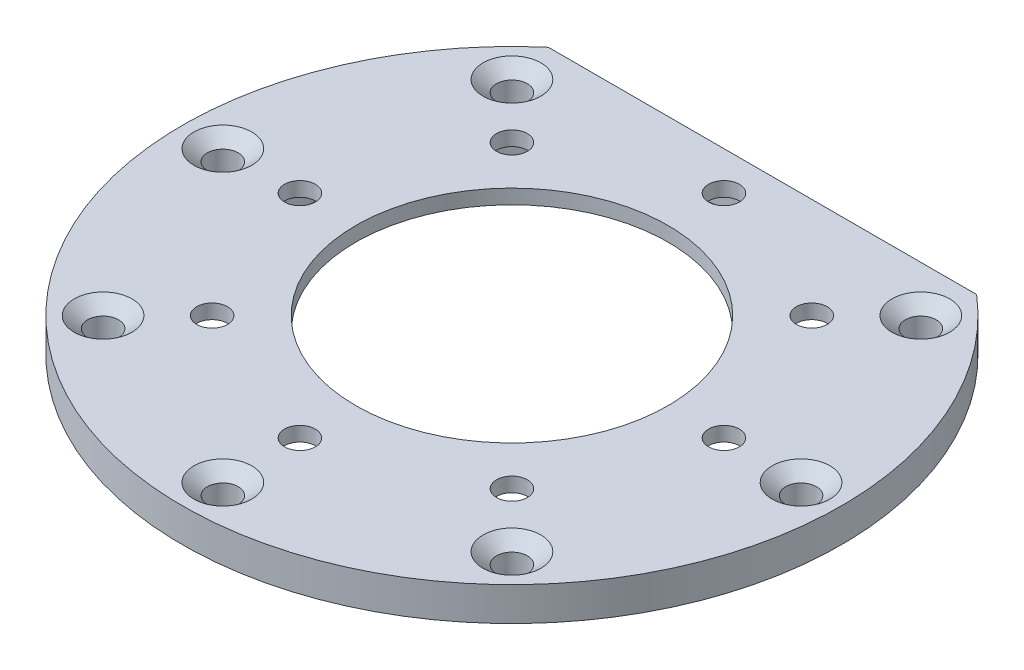
ISO-10303-21;
HEADER;
FILE_DESCRIPTION(('STEP AP214'),'2;1');
FILE_NAME('part.step','',(''),(''),'','','');
FILE_SCHEMA(('AUTOMOTIVE_DESIGN { 1 0 10303 214 1 1 1 1 }'));
ENDSEC;
DATA;
#1=APPLICATION_CONTEXT('core data for automotive mechanical design processes');
#2=APPLICATION_PROTOCOL_DEFINITION('international standard','automotive_design',2000,#1);
#3=PRODUCT_CONTEXT('',#1,'mechanical');
#4=PRODUCT('Part','Part','',(#3));
#5=PRODUCT_RELATED_PRODUCT_CATEGORY('part','',(#4));
#6=PRODUCT_DEFINITION_FORMATION('','',#4);
#7=PRODUCT_DEFINITION_CONTEXT('part definition',#1,'design');
#8=PRODUCT_DEFINITION('design','',#6,#7);
#9=PRODUCT_DEFINITION_SHAPE('','',#8);
#10=(LENGTH_UNIT() NAMED_UNIT(*) SI_UNIT(.MILLI.,.METRE.));
#11=(NAMED_UNIT(*) PLANE_ANGLE_UNIT() SI_UNIT($,.RADIAN.));
#12=(NAMED_UNIT(*) SI_UNIT($,.STERADIAN.) SOLID_ANGLE_UNIT());
#13=UNCERTAINTY_MEASURE_WITH_UNIT(LENGTH_MEASURE(1.E-05),#10,'distance_accuracy_value','');
#14=(GEOMETRIC_REPRESENTATION_CONTEXT(3) GLOBAL_UNCERTAINTY_ASSIGNED_CONTEXT((#13)) GLOBAL_UNIT_ASSIGNED_CONTEXT((#10,
#11,#12)) REPRESENTATION_CONTEXT('',''));
#15=CARTESIAN_POINT('',(0.,0.,0.));
#16=DIRECTION('',(0.,0.,1.));
#17=DIRECTION('',(1.,0.,0.));
#18=AXIS2_PLACEMENT_3D('',#15,#16,#17);
#19=CARTESIAN_POINT('',(34.2,3.5,0.));
#20=DIRECTION('',(0.,-1.,0.));
#21=DIRECTION('',(0.,0.,-1.));
#22=AXIS2_PLACEMENT_3D('',#19,#20,#21);
#23=PLANE('',#22);
#24=CARTESIAN_POINT('',(-30.,3.5,0.));
#25=DIRECTION('',(0.,1.,0.));
#26=DIRECTION('',(0.,0.,1.));
#27=AXIS2_PLACEMENT_3D('',#24,#25,#26);
#28=CIRCLE('',#27,3.);
#29=CARTESIAN_POINT('',(-30.,3.5,3.));
#30=VERTEX_POINT('',#29);
#31=EDGE_CURVE('E93',#30,#30,#28,.T.);
#32=ORIENTED_EDGE('',*,*,#31,.F.);
#33=EDGE_LOOP('',(#32));
#34=FACE_BOUND('',#33,.T.);
#35=CARTESIAN_POINT('',(-1.04744440165294E-13,3.5,30.));
#36=DIRECTION('',(0.,1.,0.));
#37=DIRECTION('',(0.,0.,1.));
#38=AXIS2_PLACEMENT_3D('',#35,#36,#37);
#39=CIRCLE('',#38,3.);
#40=CARTESIAN_POINT('',(-1.04744440165294E-13,3.5,33.));
#41=VERTEX_POINT('',#40);
#42=EDGE_CURVE('E111',#41,#41,#39,.T.);
#43=ORIENTED_EDGE('',*,*,#42,.F.);
#44=EDGE_LOOP('',(#43));
#45=FACE_BOUND('',#44,.T.);
#46=CARTESIAN_POINT('',(21.2132034355964,3.5,21.2132034355965));
#47=DIRECTION('',(0.,1.,0.));
#48=DIRECTION('',(0.,0.,1.));
#49=AXIS2_PLACEMENT_3D('',#46,#47,#48);
#50=CIRCLE('',#49,3.);
#51=CARTESIAN_POINT('',(21.2132034355964,3.5,24.2132034355965));
#52=VERTEX_POINT('',#51);
#53=EDGE_CURVE('E120',#52,#52,#50,.T.);
#54=ORIENTED_EDGE('',*,*,#53,.F.);
#55=EDGE_LOOP('',(#54));
#56=FACE_BOUND('',#55,.T.);
#57=CARTESIAN_POINT('',(0.,3.5,22.));
#58=DIRECTION('',(0.,1.,0.));
#59=DIRECTION('',(-1.,0.,0.));
#60=AXIS2_PLACEMENT_3D('',#57,#58,#59);
#61=CIRCLE('',#60,1.6);
#62=CARTESIAN_POINT('',(-1.60000000000007,3.5,22.));
#63=VERTEX_POINT('',#62);
#64=EDGE_CURVE('E130',#63,#63,#61,.T.);
#65=ORIENTED_EDGE('',*,*,#64,.F.);
#66=EDGE_LOOP('',(#65));
#67=FACE_BOUND('',#66,.T.);
#68=CARTESIAN_POINT('',(-15.5563491861041,3.5,15.556349186104));
#69=DIRECTION('',(0.,1.,0.));
#70=DIRECTION('',(-0.707106781186544,0.,-0.707106781186551));
#71=AXIS2_PLACEMENT_3D('',#68,#69,#70);
#72=CIRCLE('',#71,1.6);
#73=CARTESIAN_POINT('',(-16.6877200360026,3.5,14.4249783362055));
#74=VERTEX_POINT('',#73);
#75=EDGE_CURVE('E134',#74,#74,#72,.T.);
#76=ORIENTED_EDGE('',*,*,#75,.F.);
#77=EDGE_LOOP('',(#76));
#78=FACE_BOUND('',#77,.T.);
#79=CARTESIAN_POINT('',(-22.,3.5,0.));
#80=DIRECTION('',(0.,1.,0.));
#81=DIRECTION('',(0.,0.,-1.));
#82=AXIS2_PLACEMENT_3D('',#79,#80,#81);
#83=CIRCLE('',#82,1.6);
#84=CARTESIAN_POINT('',(-22.,3.5,-1.6));
#85=VERTEX_POINT('',#84);
#86=EDGE_CURVE('E137',#85,#85,#83,.T.);
#87=ORIENTED_EDGE('',*,*,#86,.F.);
#88=EDGE_LOOP('',(#87));
#89=FACE_BOUND('',#88,.T.);
#90=CARTESIAN_POINT('',(-15.5563491861039,3.5,-15.5563491861042));
#91=DIRECTION('',(0.,1.,0.));
#92=DIRECTION('',(0.707106781186554,0.,-0.707106781186541));
#93=AXIS2_PLACEMENT_3D('',#90,#91,#92);
#94=CIRCLE('',#93,1.6);
#95=CARTESIAN_POINT('',(-14.4249783362054,3.5,-16.6877200360026));
#96=VERTEX_POINT('',#95);
#97=EDGE_CURVE('E140',#96,#96,#94,.T.);
#98=ORIENTED_EDGE('',*,*,#97,.F.);
#99=EDGE_LOOP('',(#98));
#100=FACE_BOUND('',#99,.T.);
#101=CARTESIAN_POINT('',(2.30437768363647E-13,3.5,-22.));
#102=DIRECTION('',(0.,1.,0.));
#103=DIRECTION('',(1.,0.,0.));
#104=AXIS2_PLACEMENT_3D('',#101,#102,#103);
#105=CIRCLE('',#104,1.6);
#106=CARTESIAN_POINT('',(1.60000000000023,3.5,-22.));
#107=VERTEX_POINT('',#106);
#108=EDGE_CURVE('E143',#107,#107,#105,.T.);
#109=ORIENTED_EDGE('',*,*,#108,.F.);
#110=EDGE_LOOP('',(#109));
#111=FACE_BOUND('',#110,.T.);
#112=CARTESIAN_POINT('',(15.5563491861042,3.5,-15.5563491861039));
#113=DIRECTION('',(0.,1.,0.));
#114=DIRECTION('',(0.707106781186539,0.,0.707106781186556));
#115=AXIS2_PLACEMENT_3D('',#112,#113,#114);
#116=CIRCLE('',#115,1.6);
#117=CARTESIAN_POINT('',(16.6877200360027,3.5,-14.4249783362054));
#118=VERTEX_POINT('',#117);
#119=EDGE_CURVE('E129',#118,#118,#116,.T.);
#120=ORIENTED_EDGE('',*,*,#119,.F.);
#121=EDGE_LOOP('',(#120));
#122=FACE_BOUND('',#121,.T.);
#123=CARTESIAN_POINT('',(15.556349186104,3.5,15.5563491861041));
#124=DIRECTION('',(0.,1.,0.));
#125=DIRECTION('',(-0.707106781186549,0.,0.707106781186546));
#126=AXIS2_PLACEMENT_3D('',#123,#124,#125);
#127=CIRCLE('',#126,1.6);
#128=CARTESIAN_POINT('',(14.4249783362055,3.5,16.6877200360025));
#129=VERTEX_POINT('',#128);
#130=EDGE_CURVE('E148',#129,#129,#127,.T.);
#131=ORIENTED_EDGE('',*,*,#130,.F.);
#132=EDGE_LOOP('',(#131));
#133=FACE_BOUND('',#132,.T.);
#134=CARTESIAN_POINT('',(30.,3.5,0.));
#135=DIRECTION('',(0.,1.,0.));
#136=DIRECTION('',(0.,0.,1.));
#137=AXIS2_PLACEMENT_3D('',#134,#135,#136);
#138=CIRCLE('',#137,3.);
#139=CARTESIAN_POINT('',(30.,3.5,3.));
#140=VERTEX_POINT('',#139);
#141=EDGE_CURVE('E152',#140,#140,#138,.T.);
#142=ORIENTED_EDGE('',*,*,#141,.F.);
#143=EDGE_LOOP('',(#142));
#144=FACE_BOUND('',#143,.T.);
#145=CARTESIAN_POINT('',(22.,3.5,0.));
#146=DIRECTION('',(0.,1.,0.));
#147=DIRECTION('',(0.,0.,1.));
#148=AXIS2_PLACEMENT_3D('',#145,#146,#147);
#149=CIRCLE('',#148,1.6);
#150=CARTESIAN_POINT('',(22.,3.5,1.6));
#151=VERTEX_POINT('',#150);
#152=EDGE_CURVE('E161',#151,#151,#149,.T.);
#153=ORIENTED_EDGE('',*,*,#152,.F.);
#154=EDGE_LOOP('',(#153));
#155=FACE_BOUND('',#154,.T.);
#156=CARTESIAN_POINT('',(0.,3.5,0.));
#157=DIRECTION('',(0.,1.,0.));
#158=DIRECTION('',(0.,0.,1.));
#159=AXIS2_PLACEMENT_3D('',#156,#157,#158);
#160=CIRCLE('',#159,16.2);
#161=CARTESIAN_POINT('',(0.,3.5,16.2));
#162=VERTEX_POINT('',#161);
#163=EDGE_CURVE('E174',#162,#162,#160,.T.);
#164=ORIENTED_EDGE('',*,*,#163,.F.);
#165=EDGE_LOOP('',(#164));
#166=FACE_BOUND('',#165,.T.);
#167=CARTESIAN_POINT('',(0.,3.5,0.));
#168=DIRECTION('',(0.,1.,0.));
#169=DIRECTION('',(0.,0.,1.));
#170=AXIS2_PLACEMENT_3D('',#167,#168,#169);
#171=CIRCLE('',#170,34.2);
#172=CARTESIAN_POINT('',(-22.2180107120327,3.5,-26.));
#173=VERTEX_POINT('',#172);
#174=CARTESIAN_POINT('',(22.2180107120327,3.5,-26.));
#175=VERTEX_POINT('',#174);
#176=EDGE_CURVE('E42',#173,#175,#171,.T.);
#177=ORIENTED_EDGE('',*,*,#176,.T.);
#178=DIRECTION('',(-1.,0.,0.));
#179=VECTOR('',#178,1.);
#180=CARTESIAN_POINT('',(-22.2180107120327,3.5,-26.));
#181=LINE('',#180,#179);
#182=EDGE_CURVE('E50',#175,#173,#181,.T.);
#183=ORIENTED_EDGE('',*,*,#182,.T.);
#184=EDGE_LOOP('',(#177,#183));
#185=FACE_BOUND('',#184,.T.);
#186=CARTESIAN_POINT('',(-21.2132034355965,3.5,21.2132034355963));
#187=DIRECTION('',(0.,1.,0.));
#188=DIRECTION('',(0.,0.,1.));
#189=AXIS2_PLACEMENT_3D('',#186,#187,#188);
#190=CIRCLE('',#189,3.);
#191=CARTESIAN_POINT('',(-21.2132034355965,3.5,24.2132034355963));
#192=VERTEX_POINT('',#191);
#193=EDGE_CURVE('E102',#192,#192,#190,.T.);
#194=ORIENTED_EDGE('',*,*,#193,.F.);
#195=EDGE_LOOP('',(#194));
#196=FACE_BOUND('',#195,.T.);
#197=CARTESIAN_POINT('',(-21.2132034355962,3.5,-21.2132034355966));
#198=DIRECTION('',(0.,1.,0.));
#199=DIRECTION('',(0.,0.,1.));
#200=AXIS2_PLACEMENT_3D('',#197,#198,#199);
#201=CIRCLE('',#200,3.);
#202=CARTESIAN_POINT('',(-21.2132034355962,3.5,-18.2132034355966));
#203=VERTEX_POINT('',#202);
#204=EDGE_CURVE('E84',#203,#203,#201,.T.);
#205=ORIENTED_EDGE('',*,*,#204,.F.);
#206=EDGE_LOOP('',(#205));
#207=FACE_BOUND('',#206,.T.);
#208=CARTESIAN_POINT('',(21.2132034355967,3.5,-21.2132034355962));
#209=DIRECTION('',(0.,1.,0.));
#210=DIRECTION('',(0.,0.,1.));
#211=AXIS2_PLACEMENT_3D('',#208,#209,#210);
#212=CIRCLE('',#211,3.);
#213=CARTESIAN_POINT('',(21.2132034355967,3.5,-18.2132034355962));
#214=VERTEX_POINT('',#213);
#215=EDGE_CURVE('E72',#214,#214,#212,.T.);
#216=ORIENTED_EDGE('',*,*,#215,.F.);
#217=EDGE_LOOP('',(#216));
#218=FACE_BOUND('',#217,.T.);
#219=ADVANCED_FACE('F33',(#34,#45,#56,#67,#78,#89,#100,#111,#122,#133,#144,#155,#166,#185,#196,
#207,#218),#23,.F.);
#220=CARTESIAN_POINT('',(24.2,0.,0.));
#221=DIRECTION('',(0.,1.,0.));
#222=DIRECTION('',(0.,0.,1.));
#223=AXIS2_PLACEMENT_3D('',#220,#221,#222);
#224=PLANE('',#223);
#225=CARTESIAN_POINT('',(21.2132034355967,0.,-21.2132034355962));
#226=DIRECTION('',(0.,1.,0.));
#227=DIRECTION('',(0.,0.,1.));
#228=AXIS2_PLACEMENT_3D('',#225,#226,#227);
#229=CIRCLE('',#228,1.6);
#230=CARTESIAN_POINT('',(21.2132034355967,0.,-19.6132034355962));
#231=VERTEX_POINT('',#230);
#232=EDGE_CURVE('E81',#231,#231,#229,.T.);
#233=ORIENTED_EDGE('',*,*,#232,.T.);
#234=EDGE_LOOP('',(#233));
#235=FACE_BOUND('',#234,.T.);
#236=CARTESIAN_POINT('',(-21.2132034355962,0.,-21.2132034355966));
#237=DIRECTION('',(0.,1.,0.));
#238=DIRECTION('',(0.,0.,1.));
#239=AXIS2_PLACEMENT_3D('',#236,#237,#238);
#240=CIRCLE('',#239,1.6);
#241=CARTESIAN_POINT('',(-21.2132034355962,0.,-19.6132034355966));
#242=VERTEX_POINT('',#241);
#243=EDGE_CURVE('E90',#242,#242,#240,.T.);
#244=ORIENTED_EDGE('',*,*,#243,.T.);
#245=EDGE_LOOP('',(#244));
#246=FACE_BOUND('',#245,.T.);
#247=CARTESIAN_POINT('',(-30.,0.,0.));
#248=DIRECTION('',(0.,1.,0.));
#249=DIRECTION('',(0.,0.,1.));
#250=AXIS2_PLACEMENT_3D('',#247,#248,#249);
#251=CIRCLE('',#250,1.6);
#252=CARTESIAN_POINT('',(-30.,0.,1.6));
#253=VERTEX_POINT('',#252);
#254=EDGE_CURVE('E99',#253,#253,#251,.T.);
#255=ORIENTED_EDGE('',*,*,#254,.T.);
#256=EDGE_LOOP('',(#255));
#257=FACE_BOUND('',#256,.T.);
#258=CARTESIAN_POINT('',(-21.2132034355965,0.,21.2132034355963));
#259=DIRECTION('',(0.,1.,0.));
#260=DIRECTION('',(0.,0.,1.));
#261=AXIS2_PLACEMENT_3D('',#258,#259,#260);
#262=CIRCLE('',#261,1.6);
#263=CARTESIAN_POINT('',(-21.2132034355965,0.,22.8132034355963));
#264=VERTEX_POINT('',#263);
#265=EDGE_CURVE('E108',#264,#264,#262,.T.);
#266=ORIENTED_EDGE('',*,*,#265,.T.);
#267=EDGE_LOOP('',(#266));
#268=FACE_BOUND('',#267,.T.);
#269=CARTESIAN_POINT('',(-1.04744440165294E-13,0.,30.));
#270=DIRECTION('',(0.,1.,0.));
#271=DIRECTION('',(0.,0.,1.));
#272=AXIS2_PLACEMENT_3D('',#269,#270,#271);
#273=CIRCLE('',#272,1.6);
#274=CARTESIAN_POINT('',(-1.04744440165294E-13,0.,31.6));
#275=VERTEX_POINT('',#274);
#276=EDGE_CURVE('E117',#275,#275,#273,.T.);
#277=ORIENTED_EDGE('',*,*,#276,.T.);
#278=EDGE_LOOP('',(#277));
#279=FACE_BOUND('',#278,.T.);
#280=CARTESIAN_POINT('',(21.2132034355964,0.,21.2132034355965));
#281=DIRECTION('',(0.,1.,0.));
#282=DIRECTION('',(0.,0.,1.));
#283=AXIS2_PLACEMENT_3D('',#280,#281,#282);
#284=CIRCLE('',#283,1.6);
#285=CARTESIAN_POINT('',(21.2132034355964,0.,22.8132034355965));
#286=VERTEX_POINT('',#285);
#287=EDGE_CURVE('E126',#286,#286,#284,.T.);
#288=ORIENTED_EDGE('',*,*,#287,.T.);
#289=EDGE_LOOP('',(#288));
#290=FACE_BOUND('',#289,.T.);
#291=CARTESIAN_POINT('',(30.,0.,0.));
#292=DIRECTION('',(0.,1.,0.));
#293=DIRECTION('',(0.,0.,1.));
#294=AXIS2_PLACEMENT_3D('',#291,#292,#293);
#295=CIRCLE('',#294,1.6);
#296=CARTESIAN_POINT('',(30.,0.,1.6));
#297=VERTEX_POINT('',#296);
#298=EDGE_CURVE('E158',#297,#297,#295,.T.);
#299=ORIENTED_EDGE('',*,*,#298,.T.);
#300=EDGE_LOOP('',(#299));
#301=FACE_BOUND('',#300,.T.);
#302=CARTESIAN_POINT('',(0.,0.,0.));
#303=DIRECTION('',(0.,1.,0.));
#304=DIRECTION('',(0.,0.,1.));
#305=AXIS2_PLACEMENT_3D('',#302,#303,#304);
#306=CIRCLE('',#305,34.2);
#307=CARTESIAN_POINT('',(-22.2180107120327,0.,-26.));
#308=VERTEX_POINT('',#307);
#309=CARTESIAN_POINT('',(22.2180107120327,0.,-26.));
#310=VERTEX_POINT('',#309);
#311=EDGE_CURVE('E11',#308,#310,#306,.T.);
#312=ORIENTED_EDGE('',*,*,#311,.F.);
#313=DIRECTION('',(-1.,0.,0.));
#314=VECTOR('',#313,1.);
#315=CARTESIAN_POINT('',(-22.2180107120327,0.,-26.));
#316=LINE('',#315,#314);
#317=EDGE_CURVE('E62',#310,#308,#316,.T.);
#318=ORIENTED_EDGE('',*,*,#317,.F.);
#319=EDGE_LOOP('',(#312,#318));
#320=FACE_BOUND('',#319,.T.);
#321=CARTESIAN_POINT('',(0.,0.,0.));
#322=DIRECTION('',(0.,1.,0.));
#323=DIRECTION('',(0.,0.,1.));
#324=AXIS2_PLACEMENT_3D('',#321,#322,#323);
#325=CIRCLE('',#324,24.2);
#326=CARTESIAN_POINT('',(0.,0.,24.2));
#327=VERTEX_POINT('',#326);
#328=EDGE_CURVE('E165',#327,#327,#325,.T.);
#329=ORIENTED_EDGE('',*,*,#328,.T.);
#330=EDGE_LOOP('',(#329));
#331=FACE_BOUND('',#330,.T.);
#332=ADVANCED_FACE('F35',(#235,#246,#257,#268,#279,#290,#301,#320,#331),#224,.F.);
#333=CARTESIAN_POINT('',(0.,3.15,0.));
#334=DIRECTION('',(0.,1.,0.));
#335=DIRECTION('',(0.,0.,1.));
#336=AXIS2_PLACEMENT_3D('',#333,#334,#335);
#337=CYLINDRICAL_SURFACE('',#336,34.2);
#338=ORIENTED_EDGE('',*,*,#176,.F.);
#339=DIRECTION('',(0.,-1.,0.));
#340=VECTOR('',#339,1.);
#341=CARTESIAN_POINT('',(-22.2180107120327,3.5,-26.));
#342=LINE('',#341,#340);
#343=EDGE_CURVE('E56',#173,#308,#342,.T.);
#344=ORIENTED_EDGE('',*,*,#343,.T.);
#345=ORIENTED_EDGE('',*,*,#311,.T.);
#346=DIRECTION('',(0.,-1.,0.));
#347=VECTOR('',#346,1.);
#348=CARTESIAN_POINT('',(22.2180107120327,3.5,-26.));
#349=LINE('',#348,#347);
#350=EDGE_CURVE('E59',#175,#310,#349,.T.);
#351=ORIENTED_EDGE('',*,*,#350,.F.);
#352=EDGE_LOOP('',(#338,#344,#345,#351));
#353=FACE_BOUND('',#352,.T.);
#354=ADVANCED_FACE('F71',(#353),#337,.T.);
#355=CARTESIAN_POINT('',(0.,3.15,0.));
#356=DIRECTION('',(0.,1.,0.));
#357=DIRECTION('',(0.,0.,1.));
#358=AXIS2_PLACEMENT_3D('',#355,#356,#357);
#359=CYLINDRICAL_SURFACE('',#358,16.2);
#360=CARTESIAN_POINT('',(0.,2.,0.));
#361=DIRECTION('',(0.,1.,0.));
#362=DIRECTION('',(0.,0.,1.));
#363=AXIS2_PLACEMENT_3D('',#360,#361,#362);
#364=CIRCLE('',#363,16.2);
#365=CARTESIAN_POINT('',(0.,2.,16.2));
#366=VERTEX_POINT('',#365);
#367=EDGE_CURVE('E171',#366,#366,#364,.T.);
#368=ORIENTED_EDGE('',*,*,#367,.F.);
#369=EDGE_LOOP('',(#368));
#370=FACE_BOUND('',#369,.T.);
#371=ORIENTED_EDGE('',*,*,#163,.T.);
#372=EDGE_LOOP('',(#371));
#373=FACE_BOUND('',#372,.T.);
#374=ADVANCED_FACE('F228',(#370,#373),#359,.F.);
#375=CARTESIAN_POINT('',(16.2,2.,0.));
#376=DIRECTION('',(0.,1.,0.));
#377=DIRECTION('',(0.,0.,1.));
#378=AXIS2_PLACEMENT_3D('',#375,#376,#377);
#379=PLANE('',#378);
#380=CARTESIAN_POINT('',(0.,2.,22.));
#381=DIRECTION('',(0.,1.,0.));
#382=DIRECTION('',(0.,0.,1.));
#383=AXIS2_PLACEMENT_3D('',#380,#381,#382);
#384=CIRCLE('',#383,1.6);
#385=CARTESIAN_POINT('',(0.,2.,23.6));
#386=VERTEX_POINT('',#385);
#387=EDGE_CURVE('E37',#386,#386,#384,.T.);
#388=ORIENTED_EDGE('',*,*,#387,.T.);
#389=EDGE_LOOP('',(#388));
#390=FACE_BOUND('',#389,.T.);
#391=CARTESIAN_POINT('',(-15.5563491861041,2.,15.556349186104));
#392=DIRECTION('',(0.,1.,0.));
#393=DIRECTION('',(0.,0.,1.));
#394=AXIS2_PLACEMENT_3D('',#391,#392,#393);
#395=CIRCLE('',#394,1.6);
#396=CARTESIAN_POINT('',(-15.5563491861041,2.,17.156349186104));
#397=VERTEX_POINT('',#396);
#398=EDGE_CURVE('E192',#397,#397,#395,.T.);
#399=ORIENTED_EDGE('',*,*,#398,.T.);
#400=EDGE_LOOP('',(#399));
#401=FACE_BOUND('',#400,.T.);
#402=CARTESIAN_POINT('',(-22.,2.,0.));
#403=DIRECTION('',(0.,1.,0.));
#404=DIRECTION('',(0.,0.,1.));
#405=AXIS2_PLACEMENT_3D('',#402,#403,#404);
#406=CIRCLE('',#405,1.6);
#407=CARTESIAN_POINT('',(-22.,2.,1.6));
#408=VERTEX_POINT('',#407);
#409=EDGE_CURVE('E190',#408,#408,#406,.T.);
#410=ORIENTED_EDGE('',*,*,#409,.T.);
#411=EDGE_LOOP('',(#410));
#412=FACE_BOUND('',#411,.T.);
#413=CARTESIAN_POINT('',(-15.5563491861039,2.,-15.5563491861042));
#414=DIRECTION('',(0.,1.,0.));
#415=DIRECTION('',(0.,0.,1.));
#416=AXIS2_PLACEMENT_3D('',#413,#414,#415);
#417=CIRCLE('',#416,1.6);
#418=CARTESIAN_POINT('',(-15.5563491861039,2.,-13.9563491861042));
#419=VERTEX_POINT('',#418);
#420=EDGE_CURVE('E187',#419,#419,#417,.T.);
#421=ORIENTED_EDGE('',*,*,#420,.T.);
#422=EDGE_LOOP('',(#421));
#423=FACE_BOUND('',#422,.T.);
#424=CARTESIAN_POINT('',(2.30437768363647E-13,2.,-22.));
#425=DIRECTION('',(0.,1.,0.));
#426=DIRECTION('',(0.,0.,1.));
#427=AXIS2_PLACEMENT_3D('',#424,#425,#426);
#428=CIRCLE('',#427,1.6);
#429=CARTESIAN_POINT('',(2.30437768363647E-13,2.,-20.4));
#430=VERTEX_POINT('',#429);
#431=EDGE_CURVE('E184',#430,#430,#428,.T.);
#432=ORIENTED_EDGE('',*,*,#431,.T.);
#433=EDGE_LOOP('',(#432));
#434=FACE_BOUND('',#433,.T.);
#435=CARTESIAN_POINT('',(15.5563491861042,2.,-15.5563491861039));
#436=DIRECTION('',(0.,1.,0.));
#437=DIRECTION('',(0.,0.,1.));
#438=AXIS2_PLACEMENT_3D('',#435,#436,#437);
#439=CIRCLE('',#438,1.6);
#440=CARTESIAN_POINT('',(15.5563491861042,2.,-13.9563491861039));
#441=VERTEX_POINT('',#440);
#442=EDGE_CURVE('E133',#441,#441,#439,.T.);
#443=ORIENTED_EDGE('',*,*,#442,.T.);
#444=EDGE_LOOP('',(#443));
#445=FACE_BOUND('',#444,.T.);
#446=CARTESIAN_POINT('',(15.556349186104,2.,15.5563491861041));
#447=DIRECTION('',(0.,1.,0.));
#448=DIRECTION('',(0.,0.,1.));
#449=AXIS2_PLACEMENT_3D('',#446,#447,#448);
#450=CIRCLE('',#449,1.6);
#451=CARTESIAN_POINT('',(15.556349186104,2.,17.1563491861041));
#452=VERTEX_POINT('',#451);
#453=EDGE_CURVE('E151',#452,#452,#450,.T.);
#454=ORIENTED_EDGE('',*,*,#453,.T.);
#455=EDGE_LOOP('',(#454));
#456=FACE_BOUND('',#455,.T.);
#457=CARTESIAN_POINT('',(22.,2.,0.));
#458=DIRECTION('',(0.,1.,0.));
#459=DIRECTION('',(0.,0.,1.));
#460=AXIS2_PLACEMENT_3D('',#457,#458,#459);
#461=CIRCLE('',#460,1.6);
#462=CARTESIAN_POINT('',(22.,2.,1.6));
#463=VERTEX_POINT('',#462);
#464=EDGE_CURVE('E164',#463,#463,#461,.T.);
#465=ORIENTED_EDGE('',*,*,#464,.T.);
#466=EDGE_LOOP('',(#465));
#467=FACE_BOUND('',#466,.T.);
#468=CARTESIAN_POINT('',(0.,2.,0.));
#469=DIRECTION('',(0.,1.,0.));
#470=DIRECTION('',(0.,0.,1.));
#471=AXIS2_PLACEMENT_3D('',#468,#469,#470);
#472=CIRCLE('',#471,24.2);
#473=CARTESIAN_POINT('',(0.,2.,24.2));
#474=VERTEX_POINT('',#473);
#475=EDGE_CURVE('E168',#474,#474,#472,.T.);
#476=ORIENTED_EDGE('',*,*,#475,.F.);
#477=EDGE_LOOP('',(#476));
#478=FACE_BOUND('',#477,.T.);
#479=ORIENTED_EDGE('',*,*,#367,.T.);
#480=EDGE_LOOP('',(#479));
#481=FACE_BOUND('',#480,.T.);
#482=ADVANCED_FACE('F199',(#390,#401,#412,#423,#434,#445,#456,#467,#478,#481),#379,.F.);
#483=CARTESIAN_POINT('',(0.,3.15,0.));
#484=DIRECTION('',(0.,1.,0.));
#485=DIRECTION('',(0.,0.,1.));
#486=AXIS2_PLACEMENT_3D('',#483,#484,#485);
#487=CYLINDRICAL_SURFACE('',#486,24.2);
#488=ORIENTED_EDGE('',*,*,#328,.F.);
#489=EDGE_LOOP('',(#488));
#490=FACE_BOUND('',#489,.T.);
#491=ORIENTED_EDGE('',*,*,#475,.T.);
#492=EDGE_LOOP('',(#491));
#493=FACE_BOUND('',#492,.T.);
#494=ADVANCED_FACE('F240',(#490,#493),#487,.F.);
#495=CARTESIAN_POINT('',(22.,0.,0.));
#496=DIRECTION('',(0.,1.,0.));
#497=DIRECTION('',(0.,0.,1.));
#498=AXIS2_PLACEMENT_3D('',#495,#496,#497);
#499=CYLINDRICAL_SURFACE('',#498,1.6);
#500=ORIENTED_EDGE('',*,*,#152,.T.);
#501=EDGE_LOOP('',(#500));
#502=FACE_BOUND('',#501,.T.);
#503=ORIENTED_EDGE('',*,*,#464,.F.);
#504=EDGE_LOOP('',(#503));
#505=FACE_BOUND('',#504,.T.);
#506=ADVANCED_FACE('F325',(#502,#505),#499,.F.);
#507=CARTESIAN_POINT('',(30.,3.5,0.));
#508=DIRECTION('',(0.,1.,0.));
#509=DIRECTION('',(0.,0.,1.));
#510=AXIS2_PLACEMENT_3D('',#507,#508,#509);
#511=CYLINDRICAL_SURFACE('',#510,1.6);
#512=ORIENTED_EDGE('',*,*,#298,.F.);
#513=EDGE_LOOP('',(#512));
#514=FACE_BOUND('',#513,.T.);
#515=CARTESIAN_POINT('',(30.,2.32526051635181,0.));
#516=DIRECTION('',(0.,1.,0.));
#517=DIRECTION('',(0.,0.,1.));
#518=AXIS2_PLACEMENT_3D('',#515,#516,#517);
#519=CIRCLE('',#518,1.6);
#520=CARTESIAN_POINT('',(30.,2.32526051635181,1.6));
#521=VERTEX_POINT('',#520);
#522=EDGE_CURVE('E155',#521,#521,#519,.T.);
#523=ORIENTED_EDGE('',*,*,#522,.T.);
#524=EDGE_LOOP('',(#523));
#525=FACE_BOUND('',#524,.T.);
#526=ADVANCED_FACE('F328',(#514,#525),#511,.F.);
#527=CARTESIAN_POINT('',(30.,3.5,0.));
#528=DIRECTION('',(0.,1.,0.));
#529=DIRECTION('',(0.,0.,1.));
#530=AXIS2_PLACEMENT_3D('',#527,#528,#529);
#531=CONICAL_SURFACE('',#530,3.,0.872664625997167);
#532=ORIENTED_EDGE('',*,*,#522,.F.);
#533=EDGE_LOOP('',(#532));
#534=FACE_BOUND('',#533,.T.);
#535=ORIENTED_EDGE('',*,*,#141,.T.);
#536=EDGE_LOOP('',(#535));
#537=FACE_BOUND('',#536,.T.);
#538=ADVANCED_FACE('F345',(#534,#537),#531,.F.);
#539=CARTESIAN_POINT('',(15.556349186104,0.,15.5563491861041));
#540=DIRECTION('',(0.,1.,0.));
#541=DIRECTION('',(0.,0.,1.));
#542=AXIS2_PLACEMENT_3D('',#539,#540,#541);
#543=CYLINDRICAL_SURFACE('',#542,1.6);
#544=ORIENTED_EDGE('',*,*,#130,.T.);
#545=EDGE_LOOP('',(#544));
#546=FACE_BOUND('',#545,.T.);
#547=ORIENTED_EDGE('',*,*,#453,.F.);
#548=EDGE_LOOP('',(#547));
#549=FACE_BOUND('',#548,.T.);
#550=ADVANCED_FACE('F349',(#546,#549),#543,.F.);
#551=CARTESIAN_POINT('',(15.5563491861042,0.,-15.5563491861039));
#552=DIRECTION('',(0.,1.,0.));
#553=DIRECTION('',(0.,0.,1.));
#554=AXIS2_PLACEMENT_3D('',#551,#552,#553);
#555=CYLINDRICAL_SURFACE('',#554,1.6);
#556=ORIENTED_EDGE('',*,*,#119,.T.);
#557=EDGE_LOOP('',(#556));
#558=FACE_BOUND('',#557,.T.);
#559=ORIENTED_EDGE('',*,*,#442,.F.);
#560=EDGE_LOOP('',(#559));
#561=FACE_BOUND('',#560,.T.);
#562=ADVANCED_FACE('F353',(#558,#561),#555,.F.);
#563=CARTESIAN_POINT('',(2.30437768363647E-13,0.,-22.));
#564=DIRECTION('',(0.,1.,0.));
#565=DIRECTION('',(0.,0.,1.));
#566=AXIS2_PLACEMENT_3D('',#563,#564,#565);
#567=CYLINDRICAL_SURFACE('',#566,1.6);
#568=ORIENTED_EDGE('',*,*,#108,.T.);
#569=EDGE_LOOP('',(#568));
#570=FACE_BOUND('',#569,.T.);
#571=ORIENTED_EDGE('',*,*,#431,.F.);
#572=EDGE_LOOP('',(#571));
#573=FACE_BOUND('',#572,.T.);
#574=ADVANCED_FACE('F357',(#570,#573),#567,.F.);
#575=CARTESIAN_POINT('',(-15.5563491861039,0.,-15.5563491861042));
#576=DIRECTION('',(0.,1.,0.));
#577=DIRECTION('',(0.,0.,1.));
#578=AXIS2_PLACEMENT_3D('',#575,#576,#577);
#579=CYLINDRICAL_SURFACE('',#578,1.6);
#580=ORIENTED_EDGE('',*,*,#97,.T.);
#581=EDGE_LOOP('',(#580));
#582=FACE_BOUND('',#581,.T.);
#583=ORIENTED_EDGE('',*,*,#420,.F.);
#584=EDGE_LOOP('',(#583));
#585=FACE_BOUND('',#584,.T.);
#586=ADVANCED_FACE('F361',(#582,#585),#579,.F.);
#587=CARTESIAN_POINT('',(-22.,0.,0.));
#588=DIRECTION('',(0.,1.,0.));
#589=DIRECTION('',(0.,0.,1.));
#590=AXIS2_PLACEMENT_3D('',#587,#588,#589);
#591=CYLINDRICAL_SURFACE('',#590,1.6);
#592=ORIENTED_EDGE('',*,*,#86,.T.);
#593=EDGE_LOOP('',(#592));
#594=FACE_BOUND('',#593,.T.);
#595=ORIENTED_EDGE('',*,*,#409,.F.);
#596=EDGE_LOOP('',(#595));
#597=FACE_BOUND('',#596,.T.);
#598=ADVANCED_FACE('F214',(#594,#597),#591,.F.);
#599=CARTESIAN_POINT('',(-15.5563491861041,0.,15.556349186104));
#600=DIRECTION('',(0.,1.,0.));
#601=DIRECTION('',(0.,0.,1.));
#602=AXIS2_PLACEMENT_3D('',#599,#600,#601);
#603=CYLINDRICAL_SURFACE('',#602,1.6);
#604=ORIENTED_EDGE('',*,*,#75,.T.);
#605=EDGE_LOOP('',(#604));
#606=FACE_BOUND('',#605,.T.);
#607=ORIENTED_EDGE('',*,*,#398,.F.);
#608=EDGE_LOOP('',(#607));
#609=FACE_BOUND('',#608,.T.);
#610=ADVANCED_FACE('F204',(#606,#609),#603,.F.);
#611=CARTESIAN_POINT('',(0.,0.,22.));
#612=DIRECTION('',(0.,1.,0.));
#613=DIRECTION('',(0.,0.,1.));
#614=AXIS2_PLACEMENT_3D('',#611,#612,#613);
#615=CYLINDRICAL_SURFACE('',#614,1.6);
#616=ORIENTED_EDGE('',*,*,#64,.T.);
#617=EDGE_LOOP('',(#616));
#618=FACE_BOUND('',#617,.T.);
#619=ORIENTED_EDGE('',*,*,#387,.F.);
#620=EDGE_LOOP('',(#619));
#621=FACE_BOUND('',#620,.T.);
#622=ADVANCED_FACE('F201',(#618,#621),#615,.F.);
#623=CARTESIAN_POINT('',(21.2132034355964,3.5,21.2132034355965));
#624=DIRECTION('',(0.,1.,0.));
#625=DIRECTION('',(0.,0.,1.));
#626=AXIS2_PLACEMENT_3D('',#623,#624,#625);
#627=CYLINDRICAL_SURFACE('',#626,1.6);
#628=ORIENTED_EDGE('',*,*,#287,.F.);
#629=EDGE_LOOP('',(#628));
#630=FACE_BOUND('',#629,.T.);
#631=CARTESIAN_POINT('',(21.2132034355964,2.32526051635181,21.2132034355965));
#632=DIRECTION('',(0.,1.,0.));
#633=DIRECTION('',(0.,0.,1.));
#634=AXIS2_PLACEMENT_3D('',#631,#632,#633);
#635=CIRCLE('',#634,1.6);
#636=CARTESIAN_POINT('',(21.2132034355964,2.32526051635181,22.8132034355965));
#637=VERTEX_POINT('',#636);
#638=EDGE_CURVE('E123',#637,#637,#635,.T.);
#639=ORIENTED_EDGE('',*,*,#638,.T.);
#640=EDGE_LOOP('',(#639));
#641=FACE_BOUND('',#640,.T.);
#642=ADVANCED_FACE('F203',(#630,#641),#627,.F.);
#643=CARTESIAN_POINT('',(21.2132034355964,3.5,21.2132034355965));
#644=DIRECTION('',(0.,1.,0.));
#645=DIRECTION('',(0.,0.,1.));
#646=AXIS2_PLACEMENT_3D('',#643,#644,#645);
#647=CONICAL_SURFACE('',#646,3.,0.872664625997164);
#648=ORIENTED_EDGE('',*,*,#638,.F.);
#649=EDGE_LOOP('',(#648));
#650=FACE_BOUND('',#649,.T.);
#651=ORIENTED_EDGE('',*,*,#53,.T.);
#652=EDGE_LOOP('',(#651));
#653=FACE_BOUND('',#652,.T.);
#654=ADVANCED_FACE('F211',(#650,#653),#647,.F.);
#655=CARTESIAN_POINT('',(-1.04744440165294E-13,3.5,30.));
#656=DIRECTION('',(0.,1.,0.));
#657=DIRECTION('',(0.,0.,1.));
#658=AXIS2_PLACEMENT_3D('',#655,#656,#657);
#659=CYLINDRICAL_SURFACE('',#658,1.6);
#660=ORIENTED_EDGE('',*,*,#276,.F.);
#661=EDGE_LOOP('',(#660));
#662=FACE_BOUND('',#661,.T.);
#663=CARTESIAN_POINT('',(-1.04744440165294E-13,2.32526051635181,30.));
#664=DIRECTION('',(0.,1.,0.));
#665=DIRECTION('',(0.,0.,1.));
#666=AXIS2_PLACEMENT_3D('',#663,#664,#665);
#667=CIRCLE('',#666,1.6);
#668=CARTESIAN_POINT('',(-1.04744440165294E-13,2.32526051635181,31.6));
#669=VERTEX_POINT('',#668);
#670=EDGE_CURVE('E114',#669,#669,#667,.T.);
#671=ORIENTED_EDGE('',*,*,#670,.T.);
#672=EDGE_LOOP('',(#671));
#673=FACE_BOUND('',#672,.T.);
#674=ADVANCED_FACE('F293',(#662,#673),#659,.F.);
#675=CARTESIAN_POINT('',(-1.04744440165294E-13,3.5,30.));
#676=DIRECTION('',(0.,1.,0.));
#677=DIRECTION('',(0.,0.,1.));
#678=AXIS2_PLACEMENT_3D('',#675,#676,#677);
#679=CONICAL_SURFACE('',#678,3.,0.872664625997165);
#680=ORIENTED_EDGE('',*,*,#670,.F.);
#681=EDGE_LOOP('',(#680));
#682=FACE_BOUND('',#681,.T.);
#683=ORIENTED_EDGE('',*,*,#42,.T.);
#684=EDGE_LOOP('',(#683));
#685=FACE_BOUND('',#684,.T.);
#686=ADVANCED_FACE('F289',(#682,#685),#679,.F.);
#687=CARTESIAN_POINT('',(-21.2132034355965,3.5,21.2132034355963));
#688=DIRECTION('',(0.,1.,0.));
#689=DIRECTION('',(0.,0.,1.));
#690=AXIS2_PLACEMENT_3D('',#687,#688,#689);
#691=CYLINDRICAL_SURFACE('',#690,1.6);
#692=ORIENTED_EDGE('',*,*,#265,.F.);
#693=EDGE_LOOP('',(#692));
#694=FACE_BOUND('',#693,.T.);
#695=CARTESIAN_POINT('',(-21.2132034355965,2.32526051635181,21.2132034355963));
#696=DIRECTION('',(0.,1.,0.));
#697=DIRECTION('',(0.,0.,1.));
#698=AXIS2_PLACEMENT_3D('',#695,#696,#697);
#699=CIRCLE('',#698,1.6);
#700=CARTESIAN_POINT('',(-21.2132034355965,2.32526051635181,22.8132034355963));
#701=VERTEX_POINT('',#700);
#702=EDGE_CURVE('E105',#701,#701,#699,.T.);
#703=ORIENTED_EDGE('',*,*,#702,.T.);
#704=EDGE_LOOP('',(#703));
#705=FACE_BOUND('',#704,.T.);
#706=ADVANCED_FACE('F285',(#694,#705),#691,.F.);
#707=CARTESIAN_POINT('',(-21.2132034355965,3.5,21.2132034355963));
#708=DIRECTION('',(0.,1.,0.));
#709=DIRECTION('',(0.,0.,1.));
#710=AXIS2_PLACEMENT_3D('',#707,#708,#709);
#711=CONICAL_SURFACE('',#710,3.,0.872664625997164);
#712=ORIENTED_EDGE('',*,*,#702,.F.);
#713=EDGE_LOOP('',(#712));
#714=FACE_BOUND('',#713,.T.);
#715=ORIENTED_EDGE('',*,*,#193,.T.);
#716=EDGE_LOOP('',(#715));
#717=FACE_BOUND('',#716,.T.);
#718=ADVANCED_FACE('F281',(#714,#717),#711,.F.);
#719=CARTESIAN_POINT('',(-30.,3.5,0.));
#720=DIRECTION('',(0.,1.,0.));
#721=DIRECTION('',(0.,0.,1.));
#722=AXIS2_PLACEMENT_3D('',#719,#720,#721);
#723=CYLINDRICAL_SURFACE('',#722,1.6);
#724=ORIENTED_EDGE('',*,*,#254,.F.);
#725=EDGE_LOOP('',(#724));
#726=FACE_BOUND('',#725,.T.);
#727=CARTESIAN_POINT('',(-30.,2.32526051635181,0.));
#728=DIRECTION('',(0.,1.,0.));
#729=DIRECTION('',(0.,0.,1.));
#730=AXIS2_PLACEMENT_3D('',#727,#728,#729);
#731=CIRCLE('',#730,1.6);
#732=CARTESIAN_POINT('',(-30.,2.32526051635181,1.6));
#733=VERTEX_POINT('',#732);
#734=EDGE_CURVE('E96',#733,#733,#731,.T.);
#735=ORIENTED_EDGE('',*,*,#734,.T.);
#736=EDGE_LOOP('',(#735));
#737=FACE_BOUND('',#736,.T.);
#738=ADVANCED_FACE('F277',(#726,#737),#723,.F.);
#739=CARTESIAN_POINT('',(-30.,3.5,0.));
#740=DIRECTION('',(0.,1.,0.));
#741=DIRECTION('',(0.,0.,1.));
#742=AXIS2_PLACEMENT_3D('',#739,#740,#741);
#743=CONICAL_SURFACE('',#742,3.,0.872664625997164);
#744=ORIENTED_EDGE('',*,*,#734,.F.);
#745=EDGE_LOOP('',(#744));
#746=FACE_BOUND('',#745,.T.);
#747=ORIENTED_EDGE('',*,*,#31,.T.);
#748=EDGE_LOOP('',(#747));
#749=FACE_BOUND('',#748,.T.);
#750=ADVANCED_FACE('F273',(#746,#749),#743,.F.);
#751=CARTESIAN_POINT('',(-21.2132034355962,3.5,-21.2132034355966));
#752=DIRECTION('',(0.,1.,0.));
#753=DIRECTION('',(0.,0.,1.));
#754=AXIS2_PLACEMENT_3D('',#751,#752,#753);
#755=CYLINDRICAL_SURFACE('',#754,1.6);
#756=ORIENTED_EDGE('',*,*,#243,.F.);
#757=EDGE_LOOP('',(#756));
#758=FACE_BOUND('',#757,.T.);
#759=CARTESIAN_POINT('',(-21.2132034355962,2.32526051635181,-21.2132034355966));
#760=DIRECTION('',(0.,1.,0.));
#761=DIRECTION('',(0.,0.,1.));
#762=AXIS2_PLACEMENT_3D('',#759,#760,#761);
#763=CIRCLE('',#762,1.6);
#764=CARTESIAN_POINT('',(-21.2132034355962,2.32526051635181,-19.6132034355966));
#765=VERTEX_POINT('',#764);
#766=EDGE_CURVE('E87',#765,#765,#763,.T.);
#767=ORIENTED_EDGE('',*,*,#766,.T.);
#768=EDGE_LOOP('',(#767));
#769=FACE_BOUND('',#768,.T.);
#770=ADVANCED_FACE('F269',(#758,#769),#755,.F.);
#771=CARTESIAN_POINT('',(-21.2132034355962,3.5,-21.2132034355966));
#772=DIRECTION('',(0.,1.,0.));
#773=DIRECTION('',(0.,0.,1.));
#774=AXIS2_PLACEMENT_3D('',#771,#772,#773);
#775=CONICAL_SURFACE('',#774,3.,0.872664625997164);
#776=ORIENTED_EDGE('',*,*,#766,.F.);
#777=EDGE_LOOP('',(#776));
#778=FACE_BOUND('',#777,.T.);
#779=ORIENTED_EDGE('',*,*,#204,.T.);
#780=EDGE_LOOP('',(#779));
#781=FACE_BOUND('',#780,.T.);
#782=ADVANCED_FACE('F262',(#778,#781),#775,.F.);
#783=CARTESIAN_POINT('',(21.2132034355967,3.5,-21.2132034355962));
#784=DIRECTION('',(0.,1.,0.));
#785=DIRECTION('',(0.,0.,1.));
#786=AXIS2_PLACEMENT_3D('',#783,#784,#785);
#787=CYLINDRICAL_SURFACE('',#786,1.6);
#788=ORIENTED_EDGE('',*,*,#232,.F.);
#789=EDGE_LOOP('',(#788));
#790=FACE_BOUND('',#789,.T.);
#791=CARTESIAN_POINT('',(21.2132034355967,2.32526051635181,-21.2132034355962));
#792=DIRECTION('',(0.,1.,0.));
#793=DIRECTION('',(0.,0.,1.));
#794=AXIS2_PLACEMENT_3D('',#791,#792,#793);
#795=CIRCLE('',#794,1.6);
#796=CARTESIAN_POINT('',(21.2132034355967,2.32526051635181,-19.6132034355962));
#797=VERTEX_POINT('',#796);
#798=EDGE_CURVE('E75',#797,#797,#795,.T.);
#799=ORIENTED_EDGE('',*,*,#798,.T.);
#800=EDGE_LOOP('',(#799));
#801=FACE_BOUND('',#800,.T.);
#802=ADVANCED_FACE('F255',(#790,#801),#787,.F.);
#803=CARTESIAN_POINT('',(21.2132034355967,3.5,-21.2132034355962));
#804=DIRECTION('',(0.,1.,0.));
#805=DIRECTION('',(0.,0.,1.));
#806=AXIS2_PLACEMENT_3D('',#803,#804,#805);
#807=CONICAL_SURFACE('',#806,3.,0.872664625997164);
#808=ORIENTED_EDGE('',*,*,#798,.F.);
#809=EDGE_LOOP('',(#808));
#810=FACE_BOUND('',#809,.T.);
#811=ORIENTED_EDGE('',*,*,#215,.T.);
#812=EDGE_LOOP('',(#811));
#813=FACE_BOUND('',#812,.T.);
#814=ADVANCED_FACE('F253',(#810,#813),#807,.F.);
#815=CARTESIAN_POINT('',(-22.2180107120327,3.5,-26.));
#816=DIRECTION('',(0.,0.,1.));
#817=DIRECTION('',(1.,0.,0.));
#818=AXIS2_PLACEMENT_3D('',#815,#816,#817);
#819=PLANE('',#818);
#820=ORIENTED_EDGE('',*,*,#317,.T.);
#821=ORIENTED_EDGE('',*,*,#343,.F.);
#822=ORIENTED_EDGE('',*,*,#182,.F.);
#823=ORIENTED_EDGE('',*,*,#350,.T.);
#824=EDGE_LOOP('',(#820,#821,#822,#823));
#825=FACE_BOUND('',#824,.T.);
#826=ADVANCED_FACE('F61',(#825),#819,.F.);
#827=CLOSED_SHELL('',(#219,#332,#354,#374,#482,#494,#506,#526,#538,#550,#562,#574,#586,#598,
#610,#622,#642,#654,#674,#686,#706,#718,#738,#750,#770,#782,#802,#814,#826));
#828=MANIFOLD_SOLID_BREP('B2',#827);
#829=ADVANCED_BREP_SHAPE_REPRESENTATION('',(#18,#828),#14);
#830=SHAPE_DEFINITION_REPRESENTATION(#9,#829);
ENDSEC;
END-ISO-10303-21;
